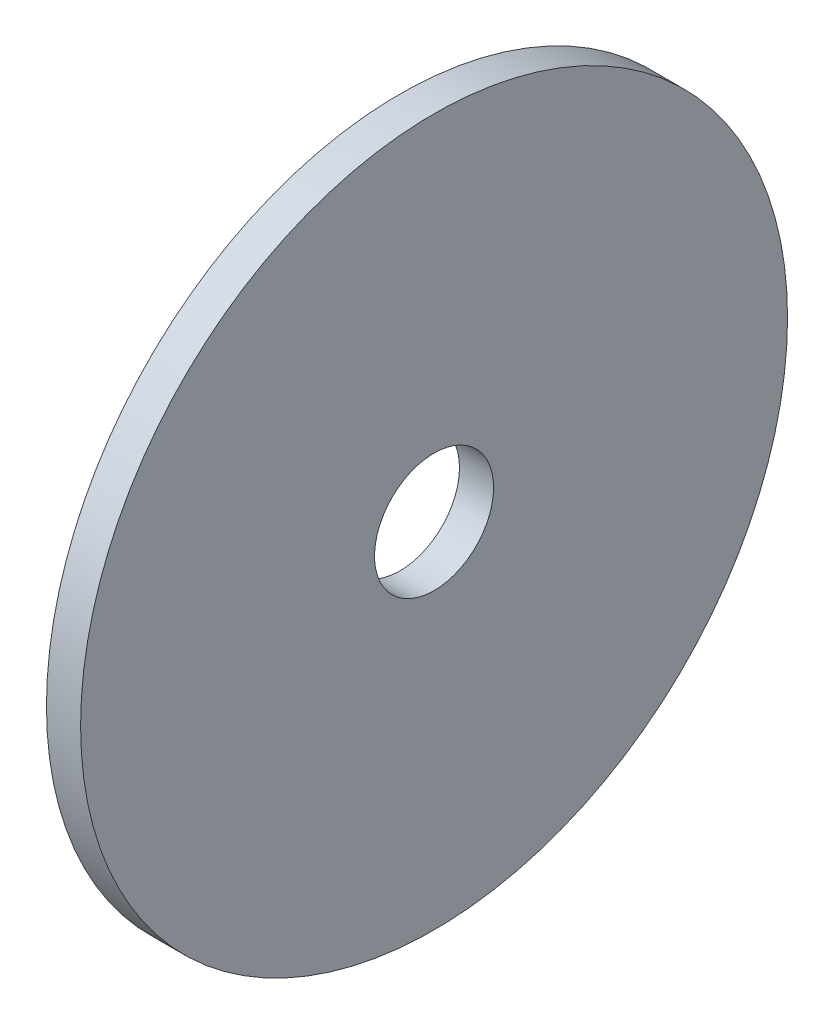
ISO-10303-21;
HEADER;
FILE_DESCRIPTION(('STEP AP214'),'2;1');
FILE_NAME('part.step','',(''),(''),'','','');
FILE_SCHEMA(('AUTOMOTIVE_DESIGN { 1 0 10303 214 1 1 1 1 }'));
ENDSEC;
DATA;
#1=APPLICATION_CONTEXT('core data for automotive mechanical design processes');
#2=APPLICATION_PROTOCOL_DEFINITION('international standard','automotive_design',2000,#1);
#3=PRODUCT_CONTEXT('',#1,'mechanical');
#4=PRODUCT('Part','Part','',(#3));
#5=PRODUCT_RELATED_PRODUCT_CATEGORY('part','',(#4));
#6=PRODUCT_DEFINITION_FORMATION('','',#4);
#7=PRODUCT_DEFINITION_CONTEXT('part definition',#1,'design');
#8=PRODUCT_DEFINITION('design','',#6,#7);
#9=PRODUCT_DEFINITION_SHAPE('','',#8);
#10=(LENGTH_UNIT() NAMED_UNIT(*) SI_UNIT(.MILLI.,.METRE.));
#11=(NAMED_UNIT(*) PLANE_ANGLE_UNIT() SI_UNIT($,.RADIAN.));
#12=(NAMED_UNIT(*) SI_UNIT($,.STERADIAN.) SOLID_ANGLE_UNIT());
#13=UNCERTAINTY_MEASURE_WITH_UNIT(LENGTH_MEASURE(1.E-05),#10,'distance_accuracy_value','');
#14=(GEOMETRIC_REPRESENTATION_CONTEXT(3) GLOBAL_UNCERTAINTY_ASSIGNED_CONTEXT((#13)) GLOBAL_UNIT_ASSIGNED_CONTEXT((#10,
#11,#12)) REPRESENTATION_CONTEXT('',''));
#15=CARTESIAN_POINT('',(0.,0.,0.));
#16=DIRECTION('',(0.,0.,1.));
#17=DIRECTION('',(1.,0.,0.));
#18=AXIS2_PLACEMENT_3D('',#15,#16,#17);
#19=CARTESIAN_POINT('',(558.8,0.,0.));
#20=DIRECTION('',(1.,0.,0.));
#21=DIRECTION('',(0.,0.,-1.));
#22=AXIS2_PLACEMENT_3D('',#19,#20,#21);
#23=PLANE('',#22);
#24=CARTESIAN_POINT('',(558.8,0.,0.));
#25=DIRECTION('',(1.,0.,0.));
#26=DIRECTION('',(0.,0.,-1.));
#27=AXIS2_PLACEMENT_3D('',#24,#25,#26);
#28=CIRCLE('',#27,9.525);
#29=CARTESIAN_POINT('',(558.8,0.,-9.525));
#30=VERTEX_POINT('',#29);
#31=EDGE_CURVE('E50',#30,#30,#28,.T.);
#32=ORIENTED_EDGE('',*,*,#31,.F.);
#33=EDGE_LOOP('',(#32));
#34=FACE_BOUND('',#33,.T.);
#35=CARTESIAN_POINT('',(558.8,0.,0.));
#36=DIRECTION('',(1.,0.,0.));
#37=DIRECTION('',(0.,0.,-1.));
#38=AXIS2_PLACEMENT_3D('',#35,#36,#37);
#39=CIRCLE('',#38,56.5412015126398);
#40=CARTESIAN_POINT('',(558.8,0.,-56.5412015126398));
#41=VERTEX_POINT('',#40);
#42=EDGE_CURVE('E61',#41,#41,#39,.T.);
#43=ORIENTED_EDGE('',*,*,#42,.T.);
#44=EDGE_LOOP('',(#43));
#45=FACE_BOUND('',#44,.T.);
#46=ADVANCED_FACE('F46',(#34,#45),#23,.T.);
#47=CARTESIAN_POINT('',(553.339,0.,0.));
#48=DIRECTION('',(1.,0.,0.));
#49=DIRECTION('',(0.,0.,-1.));
#50=AXIS2_PLACEMENT_3D('',#47,#48,#49);
#51=CYLINDRICAL_SURFACE('',#50,56.5412015126398);
#52=CARTESIAN_POINT('',(553.339,0.,0.));
#53=DIRECTION('',(1.,0.,0.));
#54=DIRECTION('',(0.,0.,-1.));
#55=AXIS2_PLACEMENT_3D('',#52,#53,#54);
#56=CIRCLE('',#55,56.5412015126398);
#57=CARTESIAN_POINT('',(553.339,0.,-56.5412015126398));
#58=VERTEX_POINT('',#57);
#59=EDGE_CURVE('E59',#58,#58,#56,.T.);
#60=ORIENTED_EDGE('',*,*,#59,.T.);
#61=EDGE_LOOP('',(#60));
#62=FACE_BOUND('',#61,.T.);
#63=ORIENTED_EDGE('',*,*,#42,.F.);
#64=EDGE_LOOP('',(#63));
#65=FACE_BOUND('',#64,.T.);
#66=ADVANCED_FACE('F69',(#62,#65),#51,.T.);
#67=CARTESIAN_POINT('',(553.339,0.,0.));
#68=DIRECTION('',(1.,0.,0.));
#69=DIRECTION('',(0.,0.,-1.));
#70=AXIS2_PLACEMENT_3D('',#67,#68,#69);
#71=CYLINDRICAL_SURFACE('',#70,9.525);
#72=CARTESIAN_POINT('',(553.339,0.,0.));
#73=DIRECTION('',(1.,0.,0.));
#74=DIRECTION('',(0.,0.,-1.));
#75=AXIS2_PLACEMENT_3D('',#72,#73,#74);
#76=CIRCLE('',#75,9.525);
#77=CARTESIAN_POINT('',(553.339,0.,-9.525));
#78=VERTEX_POINT('',#77);
#79=EDGE_CURVE('E11',#78,#78,#76,.T.);
#80=ORIENTED_EDGE('',*,*,#79,.F.);
#81=EDGE_LOOP('',(#80));
#82=FACE_BOUND('',#81,.T.);
#83=ORIENTED_EDGE('',*,*,#31,.T.);
#84=EDGE_LOOP('',(#83));
#85=FACE_BOUND('',#84,.T.);
#86=ADVANCED_FACE('F73',(#82,#85),#71,.F.);
#87=CARTESIAN_POINT('',(553.339,0.,0.));
#88=DIRECTION('',(1.,0.,0.));
#89=DIRECTION('',(0.,0.,-1.));
#90=AXIS2_PLACEMENT_3D('',#87,#88,#89);
#91=PLANE('',#90);
#92=ORIENTED_EDGE('',*,*,#79,.T.);
#93=EDGE_LOOP('',(#92));
#94=FACE_BOUND('',#93,.T.);
#95=ORIENTED_EDGE('',*,*,#59,.F.);
#96=EDGE_LOOP('',(#95));
#97=FACE_BOUND('',#96,.T.);
#98=ADVANCED_FACE('F48',(#94,#97),#91,.F.);
#99=CLOSED_SHELL('',(#46,#66,#86,#98));
#100=MANIFOLD_SOLID_BREP('B2',#99);
#101=ADVANCED_BREP_SHAPE_REPRESENTATION('',(#18,#100),#14);
#102=SHAPE_DEFINITION_REPRESENTATION(#9,#101);
ENDSEC;
END-ISO-10303-21;
